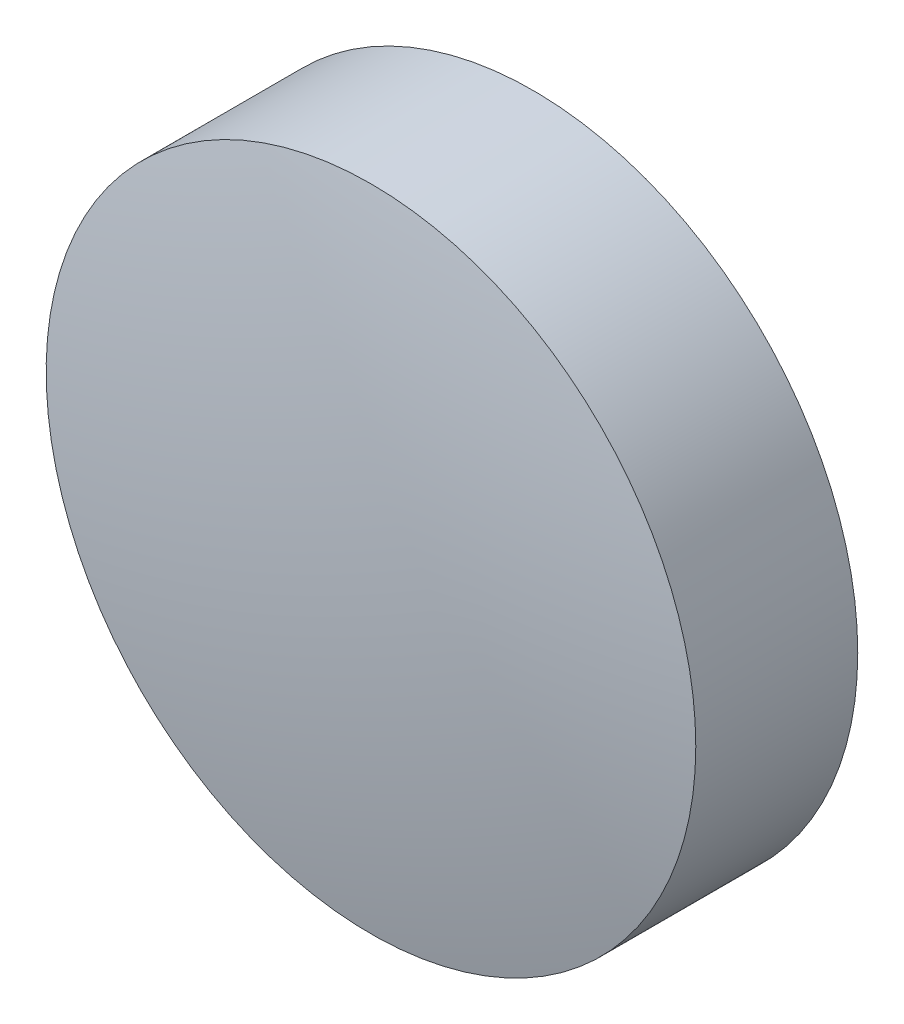
ISO-10303-21;
HEADER;
FILE_DESCRIPTION(('STEP AP214'),'2;1');
FILE_NAME('part.step','',(''),(''),'','','');
FILE_SCHEMA(('AUTOMOTIVE_DESIGN { 1 0 10303 214 1 1 1 1 }'));
ENDSEC;
DATA;
#1=APPLICATION_CONTEXT('core data for automotive mechanical design processes');
#2=APPLICATION_PROTOCOL_DEFINITION('international standard','automotive_design',2000,#1);
#3=PRODUCT_CONTEXT('',#1,'mechanical');
#4=PRODUCT('Part','Part','',(#3));
#5=PRODUCT_RELATED_PRODUCT_CATEGORY('part','',(#4));
#6=PRODUCT_DEFINITION_FORMATION('','',#4);
#7=PRODUCT_DEFINITION_CONTEXT('part definition',#1,'design');
#8=PRODUCT_DEFINITION('design','',#6,#7);
#9=PRODUCT_DEFINITION_SHAPE('','',#8);
#10=(LENGTH_UNIT() NAMED_UNIT(*) SI_UNIT(.MILLI.,.METRE.));
#11=(NAMED_UNIT(*) PLANE_ANGLE_UNIT() SI_UNIT($,.RADIAN.));
#12=(NAMED_UNIT(*) SI_UNIT($,.STERADIAN.) SOLID_ANGLE_UNIT());
#13=UNCERTAINTY_MEASURE_WITH_UNIT(LENGTH_MEASURE(1.E-05),#10,'distance_accuracy_value','');
#14=(GEOMETRIC_REPRESENTATION_CONTEXT(3) GLOBAL_UNCERTAINTY_ASSIGNED_CONTEXT((#13)) GLOBAL_UNIT_ASSIGNED_CONTEXT((#10,
#11,#12)) REPRESENTATION_CONTEXT('',''));
#15=CARTESIAN_POINT('',(0.,0.,0.));
#16=DIRECTION('',(0.,0.,1.));
#17=DIRECTION('',(1.,0.,0.));
#18=AXIS2_PLACEMENT_3D('',#15,#16,#17);
#19=CARTESIAN_POINT('',(0.,0.,-14.555));
#20=DIRECTION('',(0.,0.,1.));
#21=DIRECTION('',(0.,1.,0.));
#22=AXIS2_PLACEMENT_3D('',#19,#20,#21);
#23=SPHERICAL_SURFACE('',#22,15.45);
#24=CARTESIAN_POINT('',(0.,0.,0.600939429807707));
#25=DIRECTION('',(0.,0.,1.));
#26=DIRECTION('',(1.,0.,0.));
#27=AXIS2_PLACEMENT_3D('',#24,#25,#26);
#28=CIRCLE('',#27,3.);
#29=CARTESIAN_POINT('',(3.,0.,0.600939429807707));
#30=VERTEX_POINT('',#29);
#31=EDGE_CURVE('E8',#30,#30,#28,.T.);
#32=ORIENTED_EDGE('',*,*,#31,.T.);
#33=EDGE_LOOP('',(#32));
#34=FACE_BOUND('',#33,.T.);
#35=ADVANCED_FACE('F12',(#34),#23,.T.);
#36=CARTESIAN_POINT('',(0.,0.,4.30813204540037));
#37=DIRECTION('',(0.,0.,1.));
#38=DIRECTION('',(1.,0.,0.));
#39=AXIS2_PLACEMENT_3D('',#36,#37,#38);
#40=CYLINDRICAL_SURFACE('',#39,3.);
#41=ORIENTED_EDGE('',*,*,#31,.F.);
#42=EDGE_LOOP('',(#41));
#43=FACE_BOUND('',#42,.T.);
#44=CARTESIAN_POINT('',(0.,0.,-0.895));
#45=DIRECTION('',(0.,0.,1.));
#46=DIRECTION('',(1.,0.,0.));
#47=AXIS2_PLACEMENT_3D('',#44,#45,#46);
#48=CIRCLE('',#47,3.);
#49=CARTESIAN_POINT('',(3.,0.,-0.895));
#50=VERTEX_POINT('',#49);
#51=EDGE_CURVE('E18',#50,#50,#48,.T.);
#52=ORIENTED_EDGE('',*,*,#51,.T.);
#53=EDGE_LOOP('',(#52));
#54=FACE_BOUND('',#53,.T.);
#55=ADVANCED_FACE('F24',(#43,#54),#40,.T.);
#56=CARTESIAN_POINT('',(0.,0.,-0.895));
#57=DIRECTION('',(0.,0.,1.));
#58=DIRECTION('',(1.,0.,0.));
#59=AXIS2_PLACEMENT_3D('',#56,#57,#58);
#60=PLANE('',#59);
#61=ORIENTED_EDGE('',*,*,#51,.F.);
#62=EDGE_LOOP('',(#61));
#63=FACE_BOUND('',#62,.T.);
#64=ADVANCED_FACE('F26',(#63),#60,.F.);
#65=CLOSED_SHELL('',(#35,#55,#64));
#66=MANIFOLD_SOLID_BREP('B1',#65);
#67=ADVANCED_BREP_SHAPE_REPRESENTATION('',(#18,#66),#14);
#68=SHAPE_DEFINITION_REPRESENTATION(#9,#67);
ENDSEC;
END-ISO-10303-21;
